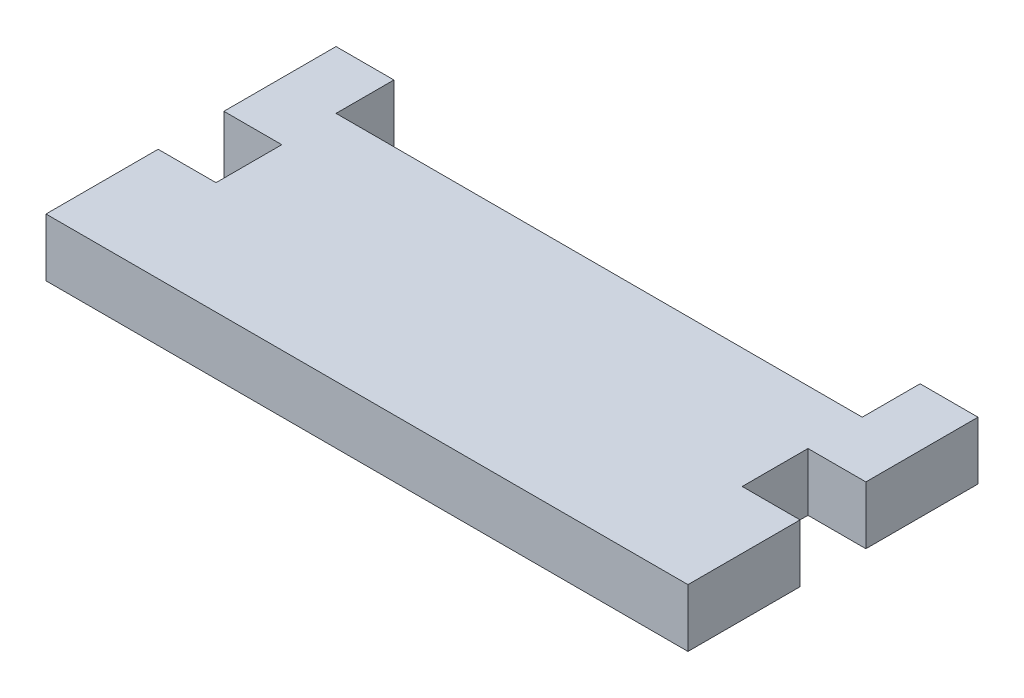
ISO-10303-21;
HEADER;
FILE_DESCRIPTION(('STEP AP214'),'2;1');
FILE_NAME('part.step','',(''),(''),'','','');
FILE_SCHEMA(('AUTOMOTIVE_DESIGN { 1 0 10303 214 1 1 1 1 }'));
ENDSEC;
DATA;
#1=APPLICATION_CONTEXT('core data for automotive mechanical design processes');
#2=APPLICATION_PROTOCOL_DEFINITION('international standard','automotive_design',2000,#1);
#3=PRODUCT_CONTEXT('',#1,'mechanical');
#4=PRODUCT('Part','Part','',(#3));
#5=PRODUCT_RELATED_PRODUCT_CATEGORY('part','',(#4));
#6=PRODUCT_DEFINITION_FORMATION('','',#4);
#7=PRODUCT_DEFINITION_CONTEXT('part definition',#1,'design');
#8=PRODUCT_DEFINITION('design','',#6,#7);
#9=PRODUCT_DEFINITION_SHAPE('','',#8);
#10=(LENGTH_UNIT() NAMED_UNIT(*) SI_UNIT(.MILLI.,.METRE.));
#11=(NAMED_UNIT(*) PLANE_ANGLE_UNIT() SI_UNIT($,.RADIAN.));
#12=(NAMED_UNIT(*) SI_UNIT($,.STERADIAN.) SOLID_ANGLE_UNIT());
#13=UNCERTAINTY_MEASURE_WITH_UNIT(LENGTH_MEASURE(1.E-05),#10,'distance_accuracy_value','');
#14=(GEOMETRIC_REPRESENTATION_CONTEXT(3) GLOBAL_UNCERTAINTY_ASSIGNED_CONTEXT((#13)) GLOBAL_UNIT_ASSIGNED_CONTEXT((#10,
#11,#12)) REPRESENTATION_CONTEXT('',''));
#15=CARTESIAN_POINT('',(0.,0.,0.));
#16=DIRECTION('',(0.,0.,1.));
#17=DIRECTION('',(1.,0.,0.));
#18=AXIS2_PLACEMENT_3D('',#15,#16,#17);
#19=CARTESIAN_POINT('',(0.,5.588,-3.175));
#20=DIRECTION('',(0.,0.,-1.));
#21=DIRECTION('',(-1.,0.,0.));
#22=AXIS2_PLACEMENT_3D('',#19,#20,#21);
#23=PLANE('',#22);
#24=DIRECTION('',(1.,0.,0.));
#25=VECTOR('',#24,1.);
#26=CARTESIAN_POINT('',(0.,0.,-3.175));
#27=LINE('',#26,#25);
#28=CARTESIAN_POINT('',(-30.988,0.,-3.175));
#29=VERTEX_POINT('',#28);
#30=CARTESIAN_POINT('',(-25.4,0.,-3.175));
#31=VERTEX_POINT('',#30);
#32=EDGE_CURVE('E229',#29,#31,#27,.T.);
#33=ORIENTED_EDGE('',*,*,#32,.T.);
#34=DIRECTION('',(0.,-1.,0.));
#35=VECTOR('',#34,1.);
#36=CARTESIAN_POINT('',(-25.4,5.588,-3.175));
#37=LINE('',#36,#35);
#38=CARTESIAN_POINT('',(-25.4,5.588,-3.175));
#39=VERTEX_POINT('',#38);
#40=EDGE_CURVE('E11',#39,#31,#37,.T.);
#41=ORIENTED_EDGE('',*,*,#40,.F.);
#42=DIRECTION('',(1.,0.,0.));
#43=VECTOR('',#42,1.);
#44=CARTESIAN_POINT('',(0.,5.588,-3.175));
#45=LINE('',#44,#43);
#46=CARTESIAN_POINT('',(-30.988,5.588,-3.175));
#47=VERTEX_POINT('',#46);
#48=EDGE_CURVE('E206',#47,#39,#45,.T.);
#49=ORIENTED_EDGE('',*,*,#48,.F.);
#50=DIRECTION('',(0.,-1.,0.));
#51=VECTOR('',#50,1.);
#52=CARTESIAN_POINT('',(-30.988,5.588,-3.175));
#53=LINE('',#52,#51);
#54=EDGE_CURVE('E174',#47,#29,#53,.T.);
#55=ORIENTED_EDGE('',*,*,#54,.T.);
#56=EDGE_LOOP('',(#33,#41,#49,#55));
#57=FACE_BOUND('',#56,.T.);
#58=ADVANCED_FACE('F35',(#57),#23,.F.);
#59=CARTESIAN_POINT('',(-25.4,5.588,0.));
#60=DIRECTION('',(1.,0.,0.));
#61=DIRECTION('',(0.,0.,-1.));
#62=AXIS2_PLACEMENT_3D('',#59,#60,#61);
#63=PLANE('',#62);
#64=DIRECTION('',(0.,0.,1.));
#65=VECTOR('',#64,1.);
#66=CARTESIAN_POINT('',(-25.4,0.,0.));
#67=LINE('',#66,#65);
#68=CARTESIAN_POINT('',(-25.4,0.,3.175));
#69=VERTEX_POINT('',#68);
#70=EDGE_CURVE('E225',#31,#69,#67,.T.);
#71=ORIENTED_EDGE('',*,*,#70,.T.);
#72=DIRECTION('',(0.,-1.,0.));
#73=VECTOR('',#72,1.);
#74=CARTESIAN_POINT('',(-25.4,5.588,3.175));
#75=LINE('',#74,#73);
#76=CARTESIAN_POINT('',(-25.4,5.588,3.175));
#77=VERTEX_POINT('',#76);
#78=EDGE_CURVE('E43',#77,#69,#75,.T.);
#79=ORIENTED_EDGE('',*,*,#78,.F.);
#80=DIRECTION('',(0.,0.,1.));
#81=VECTOR('',#80,1.);
#82=CARTESIAN_POINT('',(-25.4,5.588,0.));
#83=LINE('',#82,#81);
#84=EDGE_CURVE('E114',#39,#77,#83,.T.);
#85=ORIENTED_EDGE('',*,*,#84,.F.);
#86=ORIENTED_EDGE('',*,*,#40,.T.);
#87=EDGE_LOOP('',(#71,#79,#85,#86));
#88=FACE_BOUND('',#87,.T.);
#89=ADVANCED_FACE('F266',(#88),#63,.F.);
#90=CARTESIAN_POINT('',(0.,5.588,3.175));
#91=DIRECTION('',(0.,0.,-1.));
#92=DIRECTION('',(-1.,0.,0.));
#93=AXIS2_PLACEMENT_3D('',#90,#91,#92);
#94=PLANE('',#93);
#95=DIRECTION('',(1.,0.,0.));
#96=VECTOR('',#95,1.);
#97=CARTESIAN_POINT('',(0.,0.,3.175));
#98=LINE('',#97,#96);
#99=CARTESIAN_POINT('',(-30.988,0.,3.175));
#100=VERTEX_POINT('',#99);
#101=EDGE_CURVE('E217',#100,#69,#98,.T.);
#102=ORIENTED_EDGE('',*,*,#101,.F.);
#103=DIRECTION('',(0.,-1.,0.));
#104=VECTOR('',#103,1.);
#105=CARTESIAN_POINT('',(-30.988,5.588,3.175));
#106=LINE('',#105,#104);
#107=CARTESIAN_POINT('',(-30.988,5.588,3.175));
#108=VERTEX_POINT('',#107);
#109=EDGE_CURVE('E262',#108,#100,#106,.T.);
#110=ORIENTED_EDGE('',*,*,#109,.F.);
#111=DIRECTION('',(1.,0.,0.));
#112=VECTOR('',#111,1.);
#113=CARTESIAN_POINT('',(0.,5.588,3.175));
#114=LINE('',#113,#112);
#115=EDGE_CURVE('E201',#108,#77,#114,.T.);
#116=ORIENTED_EDGE('',*,*,#115,.T.);
#117=ORIENTED_EDGE('',*,*,#78,.T.);
#118=EDGE_LOOP('',(#102,#110,#116,#117));
#119=FACE_BOUND('',#118,.T.);
#120=ADVANCED_FACE('F264',(#119),#94,.T.);
#121=CARTESIAN_POINT('',(-30.988,5.588,0.));
#122=DIRECTION('',(1.,0.,0.));
#123=DIRECTION('',(0.,0.,-1.));
#124=AXIS2_PLACEMENT_3D('',#121,#122,#123);
#125=PLANE('',#124);
#126=DIRECTION('',(0.,0.,1.));
#127=VECTOR('',#126,1.);
#128=CARTESIAN_POINT('',(-30.988,0.,0.));
#129=LINE('',#128,#127);
#130=CARTESIAN_POINT('',(-30.988,0.,14.));
#131=VERTEX_POINT('',#130);
#132=EDGE_CURVE('E211',#100,#131,#129,.T.);
#133=ORIENTED_EDGE('',*,*,#132,.T.);
#134=DIRECTION('',(0.,-1.,0.));
#135=VECTOR('',#134,1.);
#136=CARTESIAN_POINT('',(-30.988,5.588,14.));
#137=LINE('',#136,#135);
#138=CARTESIAN_POINT('',(-30.988,5.588,14.));
#139=VERTEX_POINT('',#138);
#140=EDGE_CURVE('E260',#139,#131,#137,.T.);
#141=ORIENTED_EDGE('',*,*,#140,.F.);
#142=DIRECTION('',(0.,0.,1.));
#143=VECTOR('',#142,1.);
#144=CARTESIAN_POINT('',(-30.988,5.588,0.));
#145=LINE('',#144,#143);
#146=EDGE_CURVE('E176',#108,#139,#145,.T.);
#147=ORIENTED_EDGE('',*,*,#146,.F.);
#148=ORIENTED_EDGE('',*,*,#109,.T.);
#149=EDGE_LOOP('',(#133,#141,#147,#148));
#150=FACE_BOUND('',#149,.T.);
#151=ADVANCED_FACE('F312',(#150),#125,.F.);
#152=CARTESIAN_POINT('',(0.,5.588,14.));
#153=DIRECTION('',(0.,0.,-1.));
#154=DIRECTION('',(-1.,0.,0.));
#155=AXIS2_PLACEMENT_3D('',#152,#153,#154);
#156=PLANE('',#155);
#157=DIRECTION('',(1.,0.,0.));
#158=VECTOR('',#157,1.);
#159=CARTESIAN_POINT('',(0.,0.,14.));
#160=LINE('',#159,#158);
#161=CARTESIAN_POINT('',(30.988,0.,14.));
#162=VERTEX_POINT('',#161);
#163=EDGE_CURVE('E216',#131,#162,#160,.T.);
#164=ORIENTED_EDGE('',*,*,#163,.T.);
#165=DIRECTION('',(0.,-1.,0.));
#166=VECTOR('',#165,1.);
#167=CARTESIAN_POINT('',(30.988,5.588,14.));
#168=LINE('',#167,#166);
#169=CARTESIAN_POINT('',(30.988,5.588,14.));
#170=VERTEX_POINT('',#169);
#171=EDGE_CURVE('E258',#170,#162,#168,.T.);
#172=ORIENTED_EDGE('',*,*,#171,.F.);
#173=DIRECTION('',(1.,0.,0.));
#174=VECTOR('',#173,1.);
#175=CARTESIAN_POINT('',(0.,5.588,14.));
#176=LINE('',#175,#174);
#177=EDGE_CURVE('E196',#139,#170,#176,.T.);
#178=ORIENTED_EDGE('',*,*,#177,.F.);
#179=ORIENTED_EDGE('',*,*,#140,.T.);
#180=EDGE_LOOP('',(#164,#172,#178,#179));
#181=FACE_BOUND('',#180,.T.);
#182=ADVANCED_FACE('F310',(#181),#156,.F.);
#183=CARTESIAN_POINT('',(30.988,5.588,0.));
#184=DIRECTION('',(1.,0.,0.));
#185=DIRECTION('',(0.,0.,-1.));
#186=AXIS2_PLACEMENT_3D('',#183,#184,#185);
#187=PLANE('',#186);
#188=DIRECTION('',(0.,0.,1.));
#189=VECTOR('',#188,1.);
#190=CARTESIAN_POINT('',(30.988,0.,0.));
#191=LINE('',#190,#189);
#192=CARTESIAN_POINT('',(30.988,0.,3.175));
#193=VERTEX_POINT('',#192);
#194=EDGE_CURVE('E223',#193,#162,#191,.T.);
#195=ORIENTED_EDGE('',*,*,#194,.F.);
#196=DIRECTION('',(0.,-1.,0.));
#197=VECTOR('',#196,1.);
#198=CARTESIAN_POINT('',(30.988,5.588,3.175));
#199=LINE('',#198,#197);
#200=CARTESIAN_POINT('',(30.988,5.588,3.175));
#201=VERTEX_POINT('',#200);
#202=EDGE_CURVE('E256',#201,#193,#199,.T.);
#203=ORIENTED_EDGE('',*,*,#202,.F.);
#204=DIRECTION('',(0.,0.,1.));
#205=VECTOR('',#204,1.);
#206=CARTESIAN_POINT('',(30.988,5.588,0.));
#207=LINE('',#206,#205);
#208=EDGE_CURVE('E187',#201,#170,#207,.T.);
#209=ORIENTED_EDGE('',*,*,#208,.T.);
#210=ORIENTED_EDGE('',*,*,#171,.T.);
#211=EDGE_LOOP('',(#195,#203,#209,#210));
#212=FACE_BOUND('',#211,.T.);
#213=ADVANCED_FACE('F307',(#212),#187,.T.);
#214=CARTESIAN_POINT('',(0.,5.588,3.175));
#215=DIRECTION('',(0.,0.,1.));
#216=DIRECTION('',(1.,0.,0.));
#217=AXIS2_PLACEMENT_3D('',#214,#215,#216);
#218=PLANE('',#217);
#219=DIRECTION('',(-1.,0.,0.));
#220=VECTOR('',#219,1.);
#221=CARTESIAN_POINT('',(0.,0.,3.175));
#222=LINE('',#221,#220);
#223=CARTESIAN_POINT('',(25.4,0.,3.175));
#224=VERTEX_POINT('',#223);
#225=EDGE_CURVE('E284',#193,#224,#222,.T.);
#226=ORIENTED_EDGE('',*,*,#225,.T.);
#227=DIRECTION('',(0.,-1.,0.));
#228=VECTOR('',#227,1.);
#229=CARTESIAN_POINT('',(25.4,5.588,3.175));
#230=LINE('',#229,#228);
#231=CARTESIAN_POINT('',(25.4,5.588,3.175));
#232=VERTEX_POINT('',#231);
#233=EDGE_CURVE('E254',#232,#224,#230,.T.);
#234=ORIENTED_EDGE('',*,*,#233,.F.);
#235=DIRECTION('',(-1.,0.,0.));
#236=VECTOR('',#235,1.);
#237=CARTESIAN_POINT('',(0.,5.588,3.175));
#238=LINE('',#237,#236);
#239=EDGE_CURVE('E195',#201,#232,#238,.T.);
#240=ORIENTED_EDGE('',*,*,#239,.F.);
#241=ORIENTED_EDGE('',*,*,#202,.T.);
#242=EDGE_LOOP('',(#226,#234,#240,#241));
#243=FACE_BOUND('',#242,.T.);
#244=ADVANCED_FACE('F332',(#243),#218,.F.);
#245=CARTESIAN_POINT('',(25.4,5.588,0.));
#246=DIRECTION('',(1.,0.,0.));
#247=DIRECTION('',(0.,0.,-1.));
#248=AXIS2_PLACEMENT_3D('',#245,#246,#247);
#249=PLANE('',#248);
#250=DIRECTION('',(0.,0.,1.));
#251=VECTOR('',#250,1.);
#252=CARTESIAN_POINT('',(25.4,0.,0.));
#253=LINE('',#252,#251);
#254=CARTESIAN_POINT('',(25.4,0.,-3.175));
#255=VERTEX_POINT('',#254);
#256=EDGE_CURVE('E281',#255,#224,#253,.T.);
#257=ORIENTED_EDGE('',*,*,#256,.F.);
#258=DIRECTION('',(0.,-1.,0.));
#259=VECTOR('',#258,1.);
#260=CARTESIAN_POINT('',(25.4,5.588,-3.175));
#261=LINE('',#260,#259);
#262=CARTESIAN_POINT('',(25.4,5.588,-3.175));
#263=VERTEX_POINT('',#262);
#264=EDGE_CURVE('E252',#263,#255,#261,.T.);
#265=ORIENTED_EDGE('',*,*,#264,.F.);
#266=DIRECTION('',(0.,0.,1.));
#267=VECTOR('',#266,1.);
#268=CARTESIAN_POINT('',(25.4,5.588,0.));
#269=LINE('',#268,#267);
#270=EDGE_CURVE('E191',#263,#232,#269,.T.);
#271=ORIENTED_EDGE('',*,*,#270,.T.);
#272=ORIENTED_EDGE('',*,*,#233,.T.);
#273=EDGE_LOOP('',(#257,#265,#271,#272));
#274=FACE_BOUND('',#273,.T.);
#275=ADVANCED_FACE('F304',(#274),#249,.T.);
#276=CARTESIAN_POINT('',(0.,5.588,-3.175));
#277=DIRECTION('',(0.,0.,1.));
#278=DIRECTION('',(1.,0.,0.));
#279=AXIS2_PLACEMENT_3D('',#276,#277,#278);
#280=PLANE('',#279);
#281=DIRECTION('',(-1.,0.,0.));
#282=VECTOR('',#281,1.);
#283=CARTESIAN_POINT('',(0.,0.,-3.175));
#284=LINE('',#283,#282);
#285=CARTESIAN_POINT('',(30.988,0.,-3.175));
#286=VERTEX_POINT('',#285);
#287=EDGE_CURVE('E278',#286,#255,#284,.T.);
#288=ORIENTED_EDGE('',*,*,#287,.F.);
#289=DIRECTION('',(0.,-1.,0.));
#290=VECTOR('',#289,1.);
#291=CARTESIAN_POINT('',(30.988,5.588,-3.175));
#292=LINE('',#291,#290);
#293=CARTESIAN_POINT('',(30.988,5.588,-3.175));
#294=VERTEX_POINT('',#293);
#295=EDGE_CURVE('E250',#294,#286,#292,.T.);
#296=ORIENTED_EDGE('',*,*,#295,.F.);
#297=DIRECTION('',(-1.,0.,0.));
#298=VECTOR('',#297,1.);
#299=CARTESIAN_POINT('',(0.,5.588,-3.175));
#300=LINE('',#299,#298);
#301=EDGE_CURVE('E185',#294,#263,#300,.T.);
#302=ORIENTED_EDGE('',*,*,#301,.T.);
#303=ORIENTED_EDGE('',*,*,#264,.T.);
#304=EDGE_LOOP('',(#288,#296,#302,#303));
#305=FACE_BOUND('',#304,.T.);
#306=ADVANCED_FACE('F299',(#305),#280,.T.);
#307=CARTESIAN_POINT('',(30.988,0.,-14.));
#308=VERTEX_POINT('',#307);
#309=EDGE_CURVE('E277',#308,#286,#191,.T.);
#310=ORIENTED_EDGE('',*,*,#309,.F.);
#311=DIRECTION('',(0.,-1.,0.));
#312=VECTOR('',#311,1.);
#313=CARTESIAN_POINT('',(30.988,5.588,-14.));
#314=LINE('',#313,#312);
#315=CARTESIAN_POINT('',(30.988,5.588,-14.));
#316=VERTEX_POINT('',#315);
#317=EDGE_CURVE('E248',#316,#308,#314,.T.);
#318=ORIENTED_EDGE('',*,*,#317,.F.);
#319=EDGE_CURVE('E181',#316,#294,#207,.T.);
#320=ORIENTED_EDGE('',*,*,#319,.T.);
#321=ORIENTED_EDGE('',*,*,#295,.T.);
#322=EDGE_LOOP('',(#310,#318,#320,#321));
#323=FACE_BOUND('',#322,.T.);
#324=ADVANCED_FACE('F296',(#323),#187,.T.);
#325=CARTESIAN_POINT('',(0.,5.588,-14.));
#326=DIRECTION('',(0.,0.,-1.));
#327=DIRECTION('',(-1.,0.,0.));
#328=AXIS2_PLACEMENT_3D('',#325,#326,#327);
#329=PLANE('',#328);
#330=DIRECTION('',(1.,0.,0.));
#331=VECTOR('',#330,1.);
#332=CARTESIAN_POINT('',(0.,0.,-14.));
#333=LINE('',#332,#331);
#334=CARTESIAN_POINT('',(25.4,0.,-14.));
#335=VERTEX_POINT('',#334);
#336=EDGE_CURVE('E213',#335,#308,#333,.T.);
#337=ORIENTED_EDGE('',*,*,#336,.F.);
#338=DIRECTION('',(0.,-1.,0.));
#339=VECTOR('',#338,1.);
#340=CARTESIAN_POINT('',(25.4,5.588,-14.));
#341=LINE('',#340,#339);
#342=CARTESIAN_POINT('',(25.4,5.588,-14.));
#343=VERTEX_POINT('',#342);
#344=EDGE_CURVE('E243',#343,#335,#341,.T.);
#345=ORIENTED_EDGE('',*,*,#344,.F.);
#346=DIRECTION('',(1.,0.,0.));
#347=VECTOR('',#346,1.);
#348=CARTESIAN_POINT('',(0.,5.588,-14.));
#349=LINE('',#348,#347);
#350=EDGE_CURVE('E173',#343,#316,#349,.T.);
#351=ORIENTED_EDGE('',*,*,#350,.T.);
#352=ORIENTED_EDGE('',*,*,#317,.T.);
#353=EDGE_LOOP('',(#337,#345,#351,#352));
#354=FACE_BOUND('',#353,.T.);
#355=ADVANCED_FACE('F341',(#354),#329,.T.);
#356=CARTESIAN_POINT('',(25.4,5.588,0.));
#357=DIRECTION('',(1.,0.,0.));
#358=DIRECTION('',(0.,0.,-1.));
#359=AXIS2_PLACEMENT_3D('',#356,#357,#358);
#360=PLANE('',#359);
#361=DIRECTION('',(0.,0.,1.));
#362=VECTOR('',#361,1.);
#363=CARTESIAN_POINT('',(25.4,0.,0.));
#364=LINE('',#363,#362);
#365=CARTESIAN_POINT('',(25.4,0.,-8.412));
#366=VERTEX_POINT('',#365);
#367=EDGE_CURVE('E274',#335,#366,#364,.T.);
#368=ORIENTED_EDGE('',*,*,#367,.T.);
#369=DIRECTION('',(0.,-1.,0.));
#370=VECTOR('',#369,1.);
#371=CARTESIAN_POINT('',(25.4,5.588,-8.412));
#372=LINE('',#371,#370);
#373=CARTESIAN_POINT('',(25.4,5.588,-8.412));
#374=VERTEX_POINT('',#373);
#375=EDGE_CURVE('E238',#374,#366,#372,.T.);
#376=ORIENTED_EDGE('',*,*,#375,.F.);
#377=DIRECTION('',(0.,0.,1.));
#378=VECTOR('',#377,1.);
#379=CARTESIAN_POINT('',(25.4,5.588,0.));
#380=LINE('',#379,#378);
#381=EDGE_CURVE('E180',#343,#374,#380,.T.);
#382=ORIENTED_EDGE('',*,*,#381,.F.);
#383=ORIENTED_EDGE('',*,*,#344,.T.);
#384=EDGE_LOOP('',(#368,#376,#382,#383));
#385=FACE_BOUND('',#384,.T.);
#386=ADVANCED_FACE('F342',(#385),#360,.F.);
#387=CARTESIAN_POINT('',(0.,5.588,-8.412));
#388=DIRECTION('',(0.,0.,-1.));
#389=DIRECTION('',(-1.,0.,0.));
#390=AXIS2_PLACEMENT_3D('',#387,#388,#389);
#391=PLANE('',#390);
#392=DIRECTION('',(1.,0.,0.));
#393=VECTOR('',#392,1.);
#394=CARTESIAN_POINT('',(0.,0.,-8.412));
#395=LINE('',#394,#393);
#396=CARTESIAN_POINT('',(-25.4,0.,-8.412));
#397=VERTEX_POINT('',#396);
#398=EDGE_CURVE('E241',#397,#366,#395,.T.);
#399=ORIENTED_EDGE('',*,*,#398,.F.);
#400=DIRECTION('',(0.,-1.,0.));
#401=VECTOR('',#400,1.);
#402=CARTESIAN_POINT('',(-25.4,5.588,-8.412));
#403=LINE('',#402,#401);
#404=CARTESIAN_POINT('',(-25.4,5.588,-8.412));
#405=VERTEX_POINT('',#404);
#406=EDGE_CURVE('E163',#405,#397,#403,.T.);
#407=ORIENTED_EDGE('',*,*,#406,.F.);
#408=DIRECTION('',(1.,0.,0.));
#409=VECTOR('',#408,1.);
#410=CARTESIAN_POINT('',(0.,5.588,-8.412));
#411=LINE('',#410,#409);
#412=EDGE_CURVE('E169',#405,#374,#411,.T.);
#413=ORIENTED_EDGE('',*,*,#412,.T.);
#414=ORIENTED_EDGE('',*,*,#375,.T.);
#415=EDGE_LOOP('',(#399,#407,#413,#414));
#416=FACE_BOUND('',#415,.T.);
#417=ADVANCED_FACE('F236',(#416),#391,.T.);
#418=CARTESIAN_POINT('',(-25.4,5.588,0.));
#419=DIRECTION('',(1.,0.,0.));
#420=DIRECTION('',(0.,0.,-1.));
#421=AXIS2_PLACEMENT_3D('',#418,#419,#420);
#422=PLANE('',#421);
#423=DIRECTION('',(0.,0.,1.));
#424=VECTOR('',#423,1.);
#425=CARTESIAN_POINT('',(-25.4,0.,0.));
#426=LINE('',#425,#424);
#427=CARTESIAN_POINT('',(-25.4,0.,-14.));
#428=VERTEX_POINT('',#427);
#429=EDGE_CURVE('E158',#428,#397,#426,.T.);
#430=ORIENTED_EDGE('',*,*,#429,.F.);
#431=DIRECTION('',(0.,-1.,0.));
#432=VECTOR('',#431,1.);
#433=CARTESIAN_POINT('',(-25.4,5.588,-14.));
#434=LINE('',#433,#432);
#435=CARTESIAN_POINT('',(-25.4,5.588,-14.));
#436=VERTEX_POINT('',#435);
#437=EDGE_CURVE('E153',#436,#428,#434,.T.);
#438=ORIENTED_EDGE('',*,*,#437,.F.);
#439=DIRECTION('',(0.,0.,1.));
#440=VECTOR('',#439,1.);
#441=CARTESIAN_POINT('',(-25.4,5.588,0.));
#442=LINE('',#441,#440);
#443=EDGE_CURVE('E156',#436,#405,#442,.T.);
#444=ORIENTED_EDGE('',*,*,#443,.T.);
#445=ORIENTED_EDGE('',*,*,#406,.T.);
#446=EDGE_LOOP('',(#430,#438,#444,#445));
#447=FACE_BOUND('',#446,.T.);
#448=ADVANCED_FACE('F155',(#447),#422,.T.);
#449=CARTESIAN_POINT('',(-30.988,0.,-14.));
#450=VERTEX_POINT('',#449);
#451=EDGE_CURVE('E209',#450,#428,#333,.T.);
#452=ORIENTED_EDGE('',*,*,#451,.F.);
#453=DIRECTION('',(0.,-1.,0.));
#454=VECTOR('',#453,1.);
#455=CARTESIAN_POINT('',(-30.988,5.588,-14.));
#456=LINE('',#455,#454);
#457=CARTESIAN_POINT('',(-30.988,5.588,-14.));
#458=VERTEX_POINT('',#457);
#459=EDGE_CURVE('E103',#458,#450,#456,.T.);
#460=ORIENTED_EDGE('',*,*,#459,.F.);
#461=EDGE_CURVE('E167',#458,#436,#349,.T.);
#462=ORIENTED_EDGE('',*,*,#461,.T.);
#463=ORIENTED_EDGE('',*,*,#437,.T.);
#464=EDGE_LOOP('',(#452,#460,#462,#463));
#465=FACE_BOUND('',#464,.T.);
#466=ADVANCED_FACE('F171',(#465),#329,.T.);
#467=EDGE_CURVE('E106',#450,#29,#129,.T.);
#468=ORIENTED_EDGE('',*,*,#467,.T.);
#469=ORIENTED_EDGE('',*,*,#54,.F.);
#470=EDGE_CURVE('E51',#458,#47,#145,.T.);
#471=ORIENTED_EDGE('',*,*,#470,.F.);
#472=ORIENTED_EDGE('',*,*,#459,.T.);
#473=EDGE_LOOP('',(#468,#469,#471,#472));
#474=FACE_BOUND('',#473,.T.);
#475=ADVANCED_FACE('F315',(#474),#125,.F.);
#476=CARTESIAN_POINT('',(0.,5.588,0.));
#477=DIRECTION('',(0.,1.,0.));
#478=DIRECTION('',(0.,0.,1.));
#479=AXIS2_PLACEMENT_3D('',#476,#477,#478);
#480=PLANE('',#479);
#481=ORIENTED_EDGE('',*,*,#48,.T.);
#482=ORIENTED_EDGE('',*,*,#84,.T.);
#483=ORIENTED_EDGE('',*,*,#115,.F.);
#484=ORIENTED_EDGE('',*,*,#146,.T.);
#485=ORIENTED_EDGE('',*,*,#177,.T.);
#486=ORIENTED_EDGE('',*,*,#208,.F.);
#487=ORIENTED_EDGE('',*,*,#239,.T.);
#488=ORIENTED_EDGE('',*,*,#270,.F.);
#489=ORIENTED_EDGE('',*,*,#301,.F.);
#490=ORIENTED_EDGE('',*,*,#319,.F.);
#491=ORIENTED_EDGE('',*,*,#350,.F.);
#492=ORIENTED_EDGE('',*,*,#381,.T.);
#493=ORIENTED_EDGE('',*,*,#412,.F.);
#494=ORIENTED_EDGE('',*,*,#443,.F.);
#495=ORIENTED_EDGE('',*,*,#461,.F.);
#496=ORIENTED_EDGE('',*,*,#470,.T.);
#497=EDGE_LOOP('',(#481,#482,#483,#484,#485,#486,#487,#488,#489,#490,#491,#492,#493,#494,#495,#496));
#498=FACE_BOUND('',#497,.T.);
#499=ADVANCED_FACE('F166',(#498),#480,.T.);
#500=CARTESIAN_POINT('',(0.,0.,0.));
#501=DIRECTION('',(0.,1.,0.));
#502=DIRECTION('',(0.,0.,1.));
#503=AXIS2_PLACEMENT_3D('',#500,#501,#502);
#504=PLANE('',#503);
#505=ORIENTED_EDGE('',*,*,#32,.F.);
#506=ORIENTED_EDGE('',*,*,#467,.F.);
#507=ORIENTED_EDGE('',*,*,#451,.T.);
#508=ORIENTED_EDGE('',*,*,#429,.T.);
#509=ORIENTED_EDGE('',*,*,#398,.T.);
#510=ORIENTED_EDGE('',*,*,#367,.F.);
#511=ORIENTED_EDGE('',*,*,#336,.T.);
#512=ORIENTED_EDGE('',*,*,#309,.T.);
#513=ORIENTED_EDGE('',*,*,#287,.T.);
#514=ORIENTED_EDGE('',*,*,#256,.T.);
#515=ORIENTED_EDGE('',*,*,#225,.F.);
#516=ORIENTED_EDGE('',*,*,#194,.T.);
#517=ORIENTED_EDGE('',*,*,#163,.F.);
#518=ORIENTED_EDGE('',*,*,#132,.F.);
#519=ORIENTED_EDGE('',*,*,#101,.T.);
#520=ORIENTED_EDGE('',*,*,#70,.F.);
#521=EDGE_LOOP('',(#505,#506,#507,#508,#509,#510,#511,#512,#513,#514,#515,#516,#517,#518,#519,#520));
#522=FACE_BOUND('',#521,.T.);
#523=ADVANCED_FACE('F268',(#522),#504,.F.);
#524=CLOSED_SHELL('',(#58,#89,#120,#151,#182,#213,#244,#275,#306,#324,#355,#386,#417,#448,#466,
#475,#499,#523));
#525=MANIFOLD_SOLID_BREP('B2',#524);
#526=ADVANCED_BREP_SHAPE_REPRESENTATION('',(#18,#525),#14);
#527=SHAPE_DEFINITION_REPRESENTATION(#9,#526);
ENDSEC;
END-ISO-10303-21;
